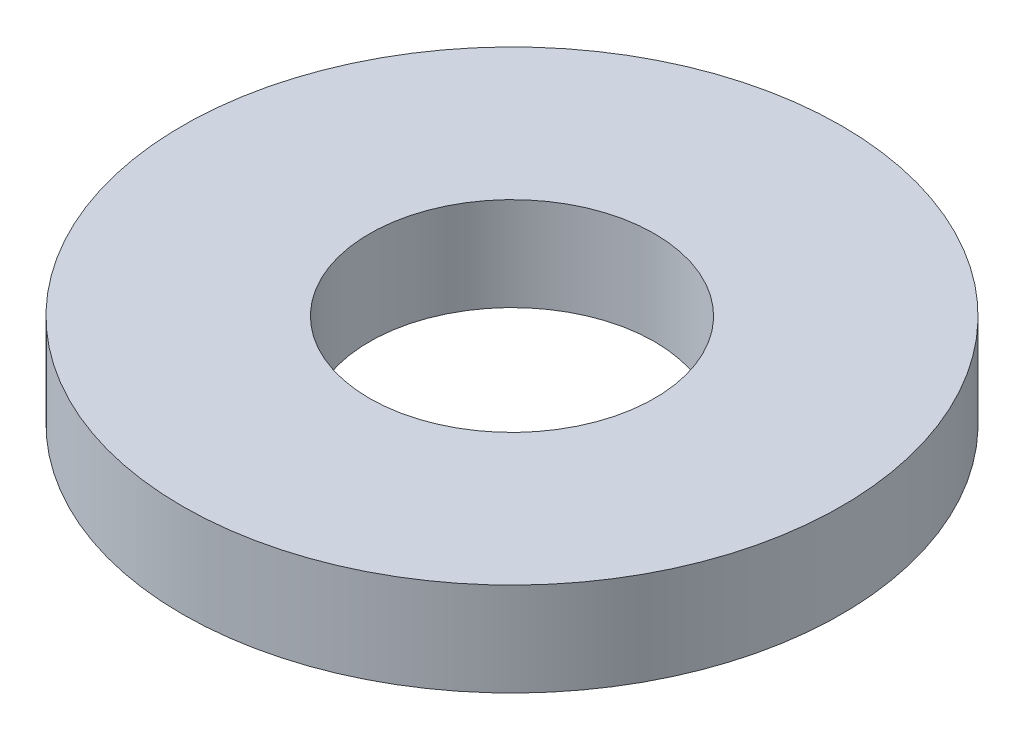
ISO-10303-21;
HEADER;
FILE_DESCRIPTION(('STEP AP214'),'2;1');
FILE_NAME('part.step','',(''),(''),'','','');
FILE_SCHEMA(('AUTOMOTIVE_DESIGN { 1 0 10303 214 1 1 1 1 }'));
ENDSEC;
DATA;
#1=APPLICATION_CONTEXT('core data for automotive mechanical design processes');
#2=APPLICATION_PROTOCOL_DEFINITION('international standard','automotive_design',2000,#1);
#3=PRODUCT_CONTEXT('',#1,'mechanical');
#4=PRODUCT('Part','Part','',(#3));
#5=PRODUCT_RELATED_PRODUCT_CATEGORY('part','',(#4));
#6=PRODUCT_DEFINITION_FORMATION('','',#4);
#7=PRODUCT_DEFINITION_CONTEXT('part definition',#1,'design');
#8=PRODUCT_DEFINITION('design','',#6,#7);
#9=PRODUCT_DEFINITION_SHAPE('','',#8);
#10=(LENGTH_UNIT() NAMED_UNIT(*) SI_UNIT(.MILLI.,.METRE.));
#11=(NAMED_UNIT(*) PLANE_ANGLE_UNIT() SI_UNIT($,.RADIAN.));
#12=(NAMED_UNIT(*) SI_UNIT($,.STERADIAN.) SOLID_ANGLE_UNIT());
#13=UNCERTAINTY_MEASURE_WITH_UNIT(LENGTH_MEASURE(1.E-05),#10,'distance_accuracy_value','');
#14=(GEOMETRIC_REPRESENTATION_CONTEXT(3) GLOBAL_UNCERTAINTY_ASSIGNED_CONTEXT((#13)) GLOBAL_UNIT_ASSIGNED_CONTEXT((#10,
#11,#12)) REPRESENTATION_CONTEXT('',''));
#15=CARTESIAN_POINT('',(0.,0.,0.));
#16=DIRECTION('',(0.,0.,1.));
#17=DIRECTION('',(1.,0.,0.));
#18=AXIS2_PLACEMENT_3D('',#15,#16,#17);
#19=CARTESIAN_POINT('',(0.,1.,0.));
#20=DIRECTION('',(0.,1.,0.));
#21=DIRECTION('',(0.,0.,1.));
#22=AXIS2_PLACEMENT_3D('',#19,#20,#21);
#23=PLANE('',#22);
#24=CARTESIAN_POINT('',(0.,1.,0.));
#25=DIRECTION('',(0.,1.,0.));
#26=DIRECTION('',(0.,0.,1.));
#27=AXIS2_PLACEMENT_3D('',#24,#25,#26);
#28=CIRCLE('',#27,3.525);
#29=CARTESIAN_POINT('',(0.,1.,3.525));
#30=VERTEX_POINT('',#29);
#31=EDGE_CURVE('E10',#30,#30,#28,.T.);
#32=ORIENTED_EDGE('',*,*,#31,.T.);
#33=EDGE_LOOP('',(#32));
#34=FACE_BOUND('',#33,.T.);
#35=CARTESIAN_POINT('',(0.,1.,0.));
#36=DIRECTION('',(0.,1.,0.));
#37=DIRECTION('',(0.,0.,1.));
#38=AXIS2_PLACEMENT_3D('',#35,#36,#37);
#39=CIRCLE('',#38,1.525);
#40=CARTESIAN_POINT('',(0.,1.,1.525));
#41=VERTEX_POINT('',#40);
#42=EDGE_CURVE('E44',#41,#41,#39,.T.);
#43=ORIENTED_EDGE('',*,*,#42,.F.);
#44=EDGE_LOOP('',(#43));
#45=FACE_BOUND('',#44,.T.);
#46=ADVANCED_FACE('F33',(#34,#45),#23,.T.);
#47=CARTESIAN_POINT('',(0.,0.,0.));
#48=DIRECTION('',(0.,1.,0.));
#49=DIRECTION('',(0.,0.,1.));
#50=AXIS2_PLACEMENT_3D('',#47,#48,#49);
#51=PLANE('',#50);
#52=CARTESIAN_POINT('',(0.,0.,0.));
#53=DIRECTION('',(0.,1.,0.));
#54=DIRECTION('',(0.,0.,1.));
#55=AXIS2_PLACEMENT_3D('',#52,#53,#54);
#56=CIRCLE('',#55,3.525);
#57=CARTESIAN_POINT('',(0.,0.,3.525));
#58=VERTEX_POINT('',#57);
#59=EDGE_CURVE('E37',#58,#58,#56,.T.);
#60=ORIENTED_EDGE('',*,*,#59,.F.);
#61=EDGE_LOOP('',(#60));
#62=FACE_BOUND('',#61,.T.);
#63=CARTESIAN_POINT('',(0.,0.,0.));
#64=DIRECTION('',(0.,1.,0.));
#65=DIRECTION('',(0.,0.,1.));
#66=AXIS2_PLACEMENT_3D('',#63,#64,#65);
#67=CIRCLE('',#66,1.525);
#68=CARTESIAN_POINT('',(0.,0.,1.525));
#69=VERTEX_POINT('',#68);
#70=EDGE_CURVE('E46',#69,#69,#67,.T.);
#71=ORIENTED_EDGE('',*,*,#70,.T.);
#72=EDGE_LOOP('',(#71));
#73=FACE_BOUND('',#72,.T.);
#74=ADVANCED_FACE('F56',(#62,#73),#51,.F.);
#75=CARTESIAN_POINT('',(0.,1.,0.));
#76=DIRECTION('',(0.,-1.,0.));
#77=DIRECTION('',(0.,0.,-1.));
#78=AXIS2_PLACEMENT_3D('',#75,#76,#77);
#79=CYLINDRICAL_SURFACE('',#78,3.525);
#80=ORIENTED_EDGE('',*,*,#31,.F.);
#81=EDGE_LOOP('',(#80));
#82=FACE_BOUND('',#81,.T.);
#83=ORIENTED_EDGE('',*,*,#59,.T.);
#84=EDGE_LOOP('',(#83));
#85=FACE_BOUND('',#84,.T.);
#86=ADVANCED_FACE('F35',(#82,#85),#79,.T.);
#87=CARTESIAN_POINT('',(0.,1.,0.));
#88=DIRECTION('',(0.,-1.,0.));
#89=DIRECTION('',(0.,0.,-1.));
#90=AXIS2_PLACEMENT_3D('',#87,#88,#89);
#91=CYLINDRICAL_SURFACE('',#90,1.525);
#92=ORIENTED_EDGE('',*,*,#42,.T.);
#93=EDGE_LOOP('',(#92));
#94=FACE_BOUND('',#93,.T.);
#95=ORIENTED_EDGE('',*,*,#70,.F.);
#96=EDGE_LOOP('',(#95));
#97=FACE_BOUND('',#96,.T.);
#98=ADVANCED_FACE('F52',(#94,#97),#91,.F.);
#99=CLOSED_SHELL('',(#46,#74,#86,#98));
#100=MANIFOLD_SOLID_BREP('B2',#99);
#101=ADVANCED_BREP_SHAPE_REPRESENTATION('',(#18,#100),#14);
#102=SHAPE_DEFINITION_REPRESENTATION(#9,#101);
ENDSEC;
END-ISO-10303-21;
